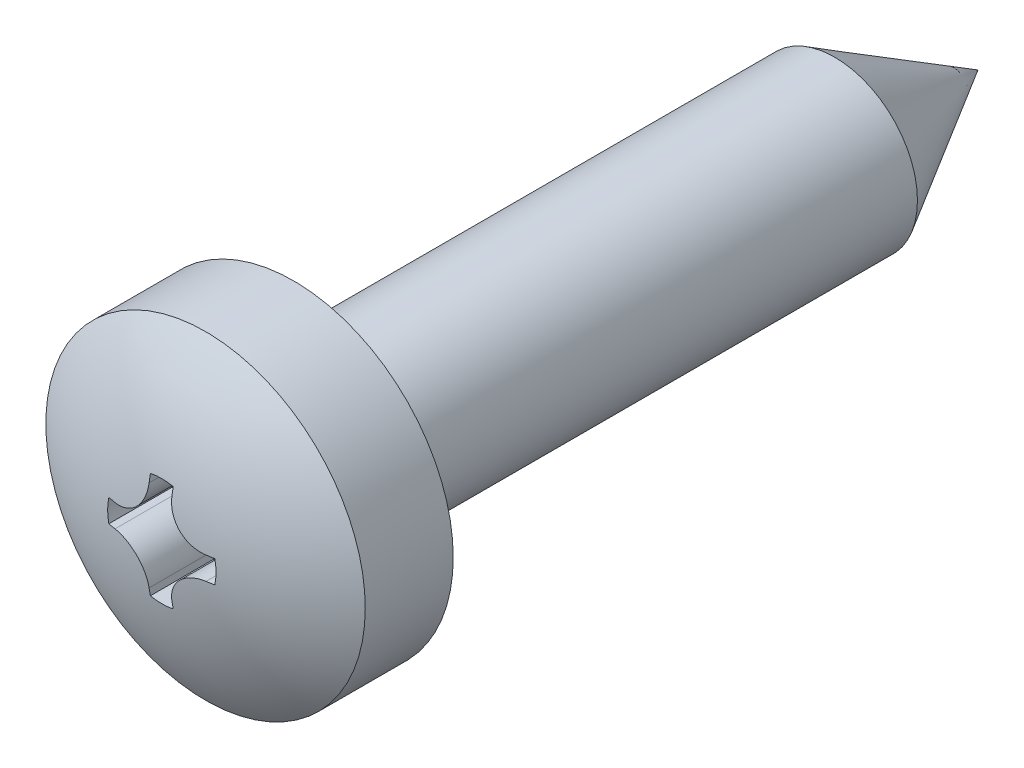
ISO-10303-21;
HEADER;
FILE_DESCRIPTION(('STEP AP214'),'2;1');
FILE_NAME('part.step','',(''),(''),'','','');
FILE_SCHEMA(('AUTOMOTIVE_DESIGN { 1 0 10303 214 1 1 1 1 }'));
ENDSEC;
DATA;
#1=APPLICATION_CONTEXT('core data for automotive mechanical design processes');
#2=APPLICATION_PROTOCOL_DEFINITION('international standard','automotive_design',2000,#1);
#3=PRODUCT_CONTEXT('',#1,'mechanical');
#4=PRODUCT('Part','Part','',(#3));
#5=PRODUCT_RELATED_PRODUCT_CATEGORY('part','',(#4));
#6=PRODUCT_DEFINITION_FORMATION('','',#4);
#7=PRODUCT_DEFINITION_CONTEXT('part definition',#1,'design');
#8=PRODUCT_DEFINITION('design','',#6,#7);
#9=PRODUCT_DEFINITION_SHAPE('','',#8);
#10=(LENGTH_UNIT() NAMED_UNIT(*) SI_UNIT(.MILLI.,.METRE.));
#11=(NAMED_UNIT(*) PLANE_ANGLE_UNIT() SI_UNIT($,.RADIAN.));
#12=(NAMED_UNIT(*) SI_UNIT($,.STERADIAN.) SOLID_ANGLE_UNIT());
#13=UNCERTAINTY_MEASURE_WITH_UNIT(LENGTH_MEASURE(1.E-05),#10,'distance_accuracy_value','');
#14=(GEOMETRIC_REPRESENTATION_CONTEXT(3) GLOBAL_UNCERTAINTY_ASSIGNED_CONTEXT((#13)) GLOBAL_UNIT_ASSIGNED_CONTEXT((#10,
#11,#12)) REPRESENTATION_CONTEXT('',''));
#15=CARTESIAN_POINT('',(0.,0.,0.));
#16=DIRECTION('',(0.,0.,1.));
#17=DIRECTION('',(1.,0.,0.));
#18=AXIS2_PLACEMENT_3D('',#15,#16,#17);
#19=CARTESIAN_POINT('',(0.,0.,9.4));
#20=DIRECTION('',(0.,0.,1.));
#21=DIRECTION('',(0.,1.,0.));
#22=AXIS2_PLACEMENT_3D('',#19,#20,#21);
#23=SPHERICAL_SURFACE('',#22,5.);
#24=CARTESIAN_POINT('',(0.,0.,13.5424630354416));
#25=DIRECTION('',(0.,0.,1.));
#26=DIRECTION('',(1.,0.,0.));
#27=AXIS2_PLACEMENT_3D('',#24,#25,#26);
#28=CIRCLE('',#27,2.8);
#29=CARTESIAN_POINT('',(2.8,0.,13.5424630354416));
#30=VERTEX_POINT('',#29);
#31=EDGE_CURVE('E190',#30,#30,#28,.T.);
#32=ORIENTED_EDGE('',*,*,#31,.T.);
#33=EDGE_LOOP('',(#32));
#34=FACE_BOUND('',#33,.T.);
#35=CARTESIAN_POINT('',(0.,0.,14.3089204515861));
#36=DIRECTION('',(0.,0.,-1.));
#37=DIRECTION('',(-1.,0.,0.));
#38=AXIS2_PLACEMENT_3D('',#35,#36,#37);
#39=CIRCLE('',#38,0.95);
#40=CARTESIAN_POINT('',(0.199999999999999,0.928708781050336,14.3089204515861));
#41=VERTEX_POINT('',#40);
#42=CARTESIAN_POINT('',(-0.199999999999997,0.928708781050336,14.3089204515861));
#43=VERTEX_POINT('',#42);
#44=EDGE_CURVE('E298',#41,#43,#39,.F.);
#45=ORIENTED_EDGE('',*,*,#44,.F.);
#46=CARTESIAN_POINT('',(0.200000000000013,0.,9.4));
#47=DIRECTION('',(-1.,0.,0.));
#48=DIRECTION('',(0.,-1.,0.));
#49=AXIS2_PLACEMENT_3D('',#46,#47,#48);
#50=CIRCLE('',#49,4.99599839871872);
#51=CARTESIAN_POINT('',(0.200000000000001,0.797500009462237,14.3319361040982));
#52=VERTEX_POINT('',#51);
#53=EDGE_CURVE('E176',#52,#41,#50,.T.);
#54=ORIENTED_EDGE('',*,*,#53,.F.);
#55=CARTESIAN_POINT('',(0.200000033472805,0.797700009462236,14.3319037583386));
#56=CARTESIAN_POINT('',(0.199959253117828,0.764708817685606,14.3372450026347));
#57=CARTESIAN_POINT('',(0.202709128813232,0.731640466129004,14.3421389681577));
#58=CARTESIAN_POINT('',(0.213653637195818,0.666282732986849,14.3509117634436));
#59=CARTESIAN_POINT('',(0.221847801353419,0.633993284617508,14.3547906805205));
#60=CARTESIAN_POINT('',(0.243555568778322,0.571088201610532,14.3614171793675));
#61=CARTESIAN_POINT('',(0.257074653927373,0.540474329048727,14.364163589265));
#62=CARTESIAN_POINT('',(0.289068737352572,0.481878485435129,14.3684353734394));
#63=CARTESIAN_POINT('',(0.307541534947129,0.453895353117194,14.3699612887238));
#64=CARTESIAN_POINT('',(0.348646595686665,0.401741777280698,14.371733860277));
#65=CARTESIAN_POINT('',(0.371219136327946,0.377524829205055,14.3719975623989));
#66=CARTESIAN_POINT('',(0.42004221247523,0.33315104363588,14.3712838517845));
#67=CARTESIAN_POINT('',(0.446293163672993,0.312994665649831,14.3703062986749));
#68=CARTESIAN_POINT('',(0.501529122246131,0.277422821121843,14.3671501235125));
#69=CARTESIAN_POINT('',(0.530496065410742,0.261978583187333,14.3649790268822));
#70=CARTESIAN_POINT('',(0.590474078177402,0.236061672214504,14.3595049326867));
#71=CARTESIAN_POINT('',(0.621484749229964,0.225588033102557,14.3562021552872));
#72=CARTESIAN_POINT('',(0.676782180778131,0.211811110107704,14.349515949383));
#73=CARTESIAN_POINT('',(0.700820773823944,0.207371844731834,14.3463573247891));
#74=CARTESIAN_POINT('',(0.749150929493059,0.201461310152338,14.3395132745871));
#75=CARTESIAN_POINT('',(0.773442081704409,0.199985810303452,14.3358286079455));
#76=CARTESIAN_POINT('',(0.797700009462238,0.200000033472804,14.3319037583386));
#77=B_SPLINE_CURVE_WITH_KNOTS('',3,(#55,#56,#57,#58,#59,#60,#61,#62,#63,#64,#65,#66,#67,#68,#69,
#70,#71,#72,#73,#74,#75,#76),.UNSPECIFIED.,.F.,.F.,(4,2,2,2,2,2,2,2,2,2,4),(0.,
0.100151318053274,0.200294018308518,0.30054008372607,0.400741688499828,0.499586204595047,
0.598441899985654,0.696681331546744,0.794901661700852,0.868668187611341,0.942329339997771),.UNSPECIFIED.);
#78=CARTESIAN_POINT('',(0.797500009462238,0.2,14.3319361040982));
#79=VERTEX_POINT('',#78);
#80=EDGE_CURVE('E288',#52,#79,#77,.T.);
#81=ORIENTED_EDGE('',*,*,#80,.T.);
#82=CARTESIAN_POINT('',(0.,0.200000000000013,9.4));
#83=DIRECTION('',(0.,1.,0.));
#84=DIRECTION('',(-1.,0.,0.));
#85=AXIS2_PLACEMENT_3D('',#82,#83,#84);
#86=CIRCLE('',#85,4.99599839871872);
#87=CARTESIAN_POINT('',(0.928708781050337,0.199999999999998,14.3089204515861));
#88=VERTEX_POINT('',#87);
#89=EDGE_CURVE('E296',#79,#88,#86,.T.);
#90=ORIENTED_EDGE('',*,*,#89,.T.);
#91=CARTESIAN_POINT('',(0.,0.,14.3089204515861));
#92=DIRECTION('',(0.,0.,-1.));
#93=DIRECTION('',(-1.,0.,0.));
#94=AXIS2_PLACEMENT_3D('',#91,#92,#93);
#95=CIRCLE('',#94,0.950000000000001);
#96=CARTESIAN_POINT('',(0.928708781050337,-0.199999999999996,14.3089204515861));
#97=VERTEX_POINT('',#96);
#98=EDGE_CURVE('E371',#88,#97,#95,.T.);
#99=ORIENTED_EDGE('',*,*,#98,.T.);
#100=CARTESIAN_POINT('',(0.,-0.200000000000022,9.4));
#101=DIRECTION('',(0.,1.,0.));
#102=DIRECTION('',(-1.,0.,0.));
#103=AXIS2_PLACEMENT_3D('',#100,#101,#102);
#104=CIRCLE('',#103,4.99599839871872);
#105=CARTESIAN_POINT('',(0.797500009462238,-0.2,14.3319361040982));
#106=VERTEX_POINT('',#105);
#107=EDGE_CURVE('E260',#106,#97,#104,.T.);
#108=ORIENTED_EDGE('',*,*,#107,.F.);
#109=CARTESIAN_POINT('',(0.200000033472805,-0.797700009462236,14.3319037583386));
#110=CARTESIAN_POINT('',(0.199959253117828,-0.764708817685605,14.3372450026347));
#111=CARTESIAN_POINT('',(0.202709128813232,-0.731640466129003,14.3421389681577));
#112=CARTESIAN_POINT('',(0.213653637195818,-0.666282732986848,14.3509117634436));
#113=CARTESIAN_POINT('',(0.221847801353419,-0.633993284617508,14.3547906805205));
#114=CARTESIAN_POINT('',(0.243555568778322,-0.571088201610531,14.3614171793675));
#115=CARTESIAN_POINT('',(0.257074653927373,-0.540474329048727,14.364163589265));
#116=CARTESIAN_POINT('',(0.289068737352572,-0.481878485435129,14.3684353734394));
#117=CARTESIAN_POINT('',(0.30754153494713,-0.453895353117194,14.3699612887238));
#118=CARTESIAN_POINT('',(0.348646595686666,-0.401741777280697,14.371733860277));
#119=CARTESIAN_POINT('',(0.371219136327946,-0.377524829205055,14.3719975623989));
#120=CARTESIAN_POINT('',(0.42004221247523,-0.33315104363588,14.3712838517845));
#121=CARTESIAN_POINT('',(0.446293163672993,-0.31299466564983,14.370306298675));
#122=CARTESIAN_POINT('',(0.501529122246131,-0.277422821121843,14.3671501235125));
#123=CARTESIAN_POINT('',(0.530496065410743,-0.261978583187333,14.3649790268822));
#124=CARTESIAN_POINT('',(0.590474078177402,-0.236061672214504,14.3595049326867));
#125=CARTESIAN_POINT('',(0.621484749229964,-0.225588033102557,14.3562021552872));
#126=CARTESIAN_POINT('',(0.676782180778131,-0.211811110107704,14.349515949383));
#127=CARTESIAN_POINT('',(0.700820773823944,-0.207371844731834,14.3463573247891));
#128=CARTESIAN_POINT('',(0.749150929493059,-0.201461310152338,14.3395132745871));
#129=CARTESIAN_POINT('',(0.773442081704409,-0.199985810303452,14.3358286079455));
#130=CARTESIAN_POINT('',(0.797700009462237,-0.200000033472804,14.3319037583386));
#131=B_SPLINE_CURVE_WITH_KNOTS('',3,(#109,#110,#111,#112,#113,#114,#115,#116,#117,#118,#119,
#120,#121,#122,#123,#124,#125,#126,#127,#128,#129,#130),.UNSPECIFIED.,.F.,.F.,(4,2,2,2,2,2,2,2,
2,2,4),(0.,0.100151318053274,0.200294018308518,0.300540083726071,0.400741688499828,
0.499586204595048,0.598441899985654,0.696681331546745,0.794901661700852,0.868668187611341,
0.94232933999777),.UNSPECIFIED.);
#132=CARTESIAN_POINT('',(0.200000000000001,-0.797500009462237,14.3319361040982));
#133=VERTEX_POINT('',#132);
#134=EDGE_CURVE('E253',#133,#106,#131,.T.);
#135=ORIENTED_EDGE('',*,*,#134,.F.);
#136=CARTESIAN_POINT('',(0.20000000000001,0.,9.4));
#137=DIRECTION('',(1.,0.,0.));
#138=DIRECTION('',(0.,1.,0.));
#139=AXIS2_PLACEMENT_3D('',#136,#137,#138);
#140=CIRCLE('',#139,4.99599839871872);
#141=CARTESIAN_POINT('',(0.199999999999999,-0.928708781050336,14.3089204515861));
#142=VERTEX_POINT('',#141);
#143=EDGE_CURVE('E250',#133,#142,#140,.T.);
#144=ORIENTED_EDGE('',*,*,#143,.T.);
#145=CARTESIAN_POINT('',(0.,0.,14.3089204515861));
#146=DIRECTION('',(0.,0.,-1.));
#147=DIRECTION('',(-1.,0.,0.));
#148=AXIS2_PLACEMENT_3D('',#145,#146,#147);
#149=CIRCLE('',#148,0.95);
#150=CARTESIAN_POINT('',(-0.199999999999997,-0.928708781050336,14.3089204515861));
#151=VERTEX_POINT('',#150);
#152=EDGE_CURVE('E247',#142,#151,#149,.T.);
#153=ORIENTED_EDGE('',*,*,#152,.T.);
#154=CARTESIAN_POINT('',(-0.200000000000015,0.,9.4));
#155=DIRECTION('',(1.,0.,0.));
#156=DIRECTION('',(0.,1.,0.));
#157=AXIS2_PLACEMENT_3D('',#154,#155,#156);
#158=CIRCLE('',#157,4.99599839871872);
#159=CARTESIAN_POINT('',(-0.2,-0.797500009462236,14.3319361040982));
#160=VERTEX_POINT('',#159);
#161=EDGE_CURVE('E244',#160,#151,#158,.T.);
#162=ORIENTED_EDGE('',*,*,#161,.F.);
#163=CARTESIAN_POINT('',(-0.200000033472803,-0.797700009462235,14.3319037583386));
#164=CARTESIAN_POINT('',(-0.199959253117827,-0.764708817685605,14.3372450026347));
#165=CARTESIAN_POINT('',(-0.202709128813231,-0.731640466129003,14.3421389681577));
#166=CARTESIAN_POINT('',(-0.213653637195817,-0.666282732986847,14.3509117634436));
#167=CARTESIAN_POINT('',(-0.221847801353417,-0.633993284617507,14.3547906805205));
#168=CARTESIAN_POINT('',(-0.243555568778321,-0.57108820161053,14.3614171793675));
#169=CARTESIAN_POINT('',(-0.257074653927372,-0.540474329048725,14.364163589265));
#170=CARTESIAN_POINT('',(-0.289068737352571,-0.481878485435128,14.3684353734394));
#171=CARTESIAN_POINT('',(-0.307541534947129,-0.453895353117193,14.3699612887238));
#172=CARTESIAN_POINT('',(-0.348646595686664,-0.401741777280696,14.371733860277));
#173=CARTESIAN_POINT('',(-0.371219136327945,-0.377524829205054,14.3719975623989));
#174=CARTESIAN_POINT('',(-0.420042212475229,-0.333151043635879,14.3712838517845));
#175=CARTESIAN_POINT('',(-0.446293163672992,-0.312994665649829,14.370306298675));
#176=CARTESIAN_POINT('',(-0.50152912224613,-0.277422821121842,14.3671501235125));
#177=CARTESIAN_POINT('',(-0.530496065410741,-0.261978583187332,14.3649790268822));
#178=CARTESIAN_POINT('',(-0.590474078177401,-0.236061672214503,14.3595049326867));
#179=CARTESIAN_POINT('',(-0.621484749229963,-0.225588033102557,14.3562021552872));
#180=CARTESIAN_POINT('',(-0.676782180778129,-0.211811110107703,14.349515949383));
#181=CARTESIAN_POINT('',(-0.700820773823943,-0.207371844731833,14.3463573247891));
#182=CARTESIAN_POINT('',(-0.749150929493057,-0.201461310152337,14.3395132745871));
#183=CARTESIAN_POINT('',(-0.773442081704407,-0.199985810303451,14.3358286079455));
#184=CARTESIAN_POINT('',(-0.797700009462235,-0.200000033472803,14.3319037583386));
#185=B_SPLINE_CURVE_WITH_KNOTS('',3,(#163,#164,#165,#166,#167,#168,#169,#170,#171,#172,#173,
#174,#175,#176,#177,#178,#179,#180,#181,#182,#183,#184),.UNSPECIFIED.,.F.,.F.,(4,2,2,2,2,2,2,2,
2,2,4),(0.,0.100151318053273,0.200294018308518,0.300540083726071,0.400741688499828,
0.499586204595048,0.598441899985654,0.696681331546744,0.794901661700852,0.868668187611341,
0.942329339997769),.UNSPECIFIED.);
#186=CARTESIAN_POINT('',(-0.797500009462236,-0.199999999999999,14.3319361040982));
#187=VERTEX_POINT('',#186);
#188=EDGE_CURVE('E236',#160,#187,#185,.T.);
#189=ORIENTED_EDGE('',*,*,#188,.T.);
#190=CARTESIAN_POINT('',(0.,-0.200000000000015,9.4));
#191=DIRECTION('',(0.,-1.,0.));
#192=DIRECTION('',(1.,0.,0.));
#193=AXIS2_PLACEMENT_3D('',#190,#191,#192);
#194=CIRCLE('',#193,4.99599839871872);
#195=CARTESIAN_POINT('',(-0.928708781050336,-0.199999999999997,14.3089204515861));
#196=VERTEX_POINT('',#195);
#197=EDGE_CURVE('E245',#187,#196,#194,.T.);
#198=ORIENTED_EDGE('',*,*,#197,.T.);
#199=CARTESIAN_POINT('',(0.,0.,14.3089204515861));
#200=DIRECTION('',(0.,0.,-1.));
#201=DIRECTION('',(-1.,0.,0.));
#202=AXIS2_PLACEMENT_3D('',#199,#200,#201);
#203=CIRCLE('',#202,0.95);
#204=CARTESIAN_POINT('',(-0.928708781050336,0.199999999999997,14.3089204515861));
#205=VERTEX_POINT('',#204);
#206=EDGE_CURVE('E410',#205,#196,#203,.F.);
#207=ORIENTED_EDGE('',*,*,#206,.F.);
#208=CARTESIAN_POINT('',(0.,0.200000000000015,9.4));
#209=DIRECTION('',(0.,-1.,0.));
#210=DIRECTION('',(1.,0.,0.));
#211=AXIS2_PLACEMENT_3D('',#208,#209,#210);
#212=CIRCLE('',#211,4.99599839871872);
#213=CARTESIAN_POINT('',(-0.797500009462236,0.199999999999999,14.3319361040982));
#214=VERTEX_POINT('',#213);
#215=EDGE_CURVE('E204',#214,#205,#212,.T.);
#216=ORIENTED_EDGE('',*,*,#215,.F.);
#217=CARTESIAN_POINT('',(-0.200000033472804,0.797700009462235,14.3319037583386));
#218=CARTESIAN_POINT('',(-0.199959253117827,0.764708817685605,14.3372450026347));
#219=CARTESIAN_POINT('',(-0.202709128813231,0.731640466129002,14.3421389681577));
#220=CARTESIAN_POINT('',(-0.213653637195817,0.666282732986847,14.3509117634436));
#221=CARTESIAN_POINT('',(-0.221847801353417,0.633993284617507,14.3547906805205));
#222=CARTESIAN_POINT('',(-0.24355556877832,0.571088201610531,14.3614171793675));
#223=CARTESIAN_POINT('',(-0.257074653927372,0.540474329048726,14.364163589265));
#224=CARTESIAN_POINT('',(-0.28906873735257,0.481878485435128,14.3684353734394));
#225=CARTESIAN_POINT('',(-0.307541534947128,0.453895353117193,14.3699612887238));
#226=CARTESIAN_POINT('',(-0.348646595686664,0.401741777280697,14.371733860277));
#227=CARTESIAN_POINT('',(-0.371219136327945,0.377524829205054,14.3719975623989));
#228=CARTESIAN_POINT('',(-0.420042212475228,0.333151043635879,14.3712838517845));
#229=CARTESIAN_POINT('',(-0.446293163672991,0.31299466564983,14.370306298675));
#230=CARTESIAN_POINT('',(-0.501529122246129,0.277422821121843,14.3671501235125));
#231=CARTESIAN_POINT('',(-0.530496065410741,0.261978583187332,14.3649790268822));
#232=CARTESIAN_POINT('',(-0.5904740781774,0.236061672214503,14.3595049326867));
#233=CARTESIAN_POINT('',(-0.621484749229962,0.225588033102557,14.3562021552872));
#234=CARTESIAN_POINT('',(-0.676782180778129,0.211811110107703,14.349515949383));
#235=CARTESIAN_POINT('',(-0.700820773823943,0.207371844731833,14.3463573247891));
#236=CARTESIAN_POINT('',(-0.749150929493057,0.201461310152337,14.3395132745871));
#237=CARTESIAN_POINT('',(-0.773442081704407,0.199985810303451,14.3358286079455));
#238=CARTESIAN_POINT('',(-0.797700009462235,0.200000033472803,14.3319037583386));
#239=B_SPLINE_CURVE_WITH_KNOTS('',3,(#217,#218,#219,#220,#221,#222,#223,#224,#225,#226,#227,
#228,#229,#230,#231,#232,#233,#234,#235,#236,#237,#238),.UNSPECIFIED.,.F.,.F.,(4,2,2,2,2,2,2,2,
2,2,4),(0.,0.100151318053274,0.200294018308518,0.30054008372607,0.400741688499828,
0.499586204595047,0.598441899985653,0.696681331546744,0.794901661700851,0.868668187611341,
0.94232933999777),.UNSPECIFIED.);
#240=CARTESIAN_POINT('',(-0.2,0.797500009462236,14.3319361040982));
#241=VERTEX_POINT('',#240);
#242=EDGE_CURVE('E196',#241,#214,#239,.T.);
#243=ORIENTED_EDGE('',*,*,#242,.F.);
#244=CARTESIAN_POINT('',(-0.200000000000015,0.,9.4));
#245=DIRECTION('',(-1.,0.,0.));
#246=DIRECTION('',(0.,-1.,0.));
#247=AXIS2_PLACEMENT_3D('',#244,#245,#246);
#248=CIRCLE('',#247,4.99599839871872);
#249=EDGE_CURVE('E193',#241,#43,#248,.T.);
#250=ORIENTED_EDGE('',*,*,#249,.T.);
#251=EDGE_LOOP('',(#45,#54,#81,#90,#99,#108,#135,#144,#153,#162,#189,#198,#207,#216,#243,#250));
#252=FACE_BOUND('',#251,.T.);
#253=ADVANCED_FACE('F41',(#34,#252),#23,.T.);
#254=CARTESIAN_POINT('',(0.,0.,0.));
#255=DIRECTION('',(0.,0.,1.));
#256=DIRECTION('',(1.,0.,0.));
#257=AXIS2_PLACEMENT_3D('',#254,#255,#256);
#258=CONICAL_SURFACE('',#257,0.,0.523598775598293);
#259=CARTESIAN_POINT('',(0.,0.,2.5114736709749));
#260=DIRECTION('',(0.,0.,1.));
#261=DIRECTION('',(1.,0.,0.));
#262=AXIS2_PLACEMENT_3D('',#259,#260,#261);
#263=CIRCLE('',#262,1.45);
#264=CARTESIAN_POINT('',(1.45,0.,2.5114736709749));
#265=VERTEX_POINT('',#264);
#266=EDGE_CURVE('E177',#265,#265,#263,.T.);
#267=ORIENTED_EDGE('',*,*,#266,.F.);
#268=EDGE_LOOP('',(#267));
#269=FACE_BOUND('',#268,.T.);
#270=CARTESIAN_POINT('',(0.,0.,0.));
#271=VERTEX_POINT('',#270);
#272=VERTEX_LOOP('',#271);
#273=FACE_BOUND('',#272,.T.);
#274=ADVANCED_FACE('F312',(#269,#273),#258,.T.);
#275=CARTESIAN_POINT('',(0.,0.,11.71));
#276=DIRECTION('',(0.,0.,1.));
#277=DIRECTION('',(1.,0.,0.));
#278=AXIS2_PLACEMENT_3D('',#275,#276,#277);
#279=CYLINDRICAL_SURFACE('',#278,2.8);
#280=ORIENTED_EDGE('',*,*,#31,.F.);
#281=EDGE_LOOP('',(#280));
#282=FACE_BOUND('',#281,.T.);
#283=CARTESIAN_POINT('',(0.,0.,12.));
#284=DIRECTION('',(0.,0.,1.));
#285=DIRECTION('',(1.,0.,0.));
#286=AXIS2_PLACEMENT_3D('',#283,#284,#285);
#287=CIRCLE('',#286,2.8);
#288=CARTESIAN_POINT('',(2.8,0.,12.));
#289=VERTEX_POINT('',#288);
#290=EDGE_CURVE('E181',#289,#289,#287,.T.);
#291=ORIENTED_EDGE('',*,*,#290,.T.);
#292=EDGE_LOOP('',(#291));
#293=FACE_BOUND('',#292,.T.);
#294=ADVANCED_FACE('F317',(#282,#293),#279,.T.);
#295=CARTESIAN_POINT('',(0.,2.8,12.));
#296=DIRECTION('',(0.,0.,1.));
#297=DIRECTION('',(1.,0.,0.));
#298=AXIS2_PLACEMENT_3D('',#295,#296,#297);
#299=PLANE('',#298);
#300=CARTESIAN_POINT('',(0.,0.,12.));
#301=DIRECTION('',(0.,0.,1.));
#302=DIRECTION('',(1.,0.,0.));
#303=AXIS2_PLACEMENT_3D('',#300,#301,#302);
#304=CIRCLE('',#303,1.55);
#305=CARTESIAN_POINT('',(1.55,0.,12.));
#306=VERTEX_POINT('',#305);
#307=EDGE_CURVE('E50',#306,#306,#304,.T.);
#308=ORIENTED_EDGE('',*,*,#307,.T.);
#309=EDGE_LOOP('',(#308));
#310=FACE_BOUND('',#309,.T.);
#311=ORIENTED_EDGE('',*,*,#290,.F.);
#312=EDGE_LOOP('',(#311));
#313=FACE_BOUND('',#312,.T.);
#314=ADVANCED_FACE('F302',(#310,#313),#299,.F.);
#315=CARTESIAN_POINT('',(0.,0.,11.71));
#316=DIRECTION('',(0.,0.,1.));
#317=DIRECTION('',(1.,0.,0.));
#318=AXIS2_PLACEMENT_3D('',#315,#316,#317);
#319=CYLINDRICAL_SURFACE('',#318,1.45);
#320=CARTESIAN_POINT('',(0.,0.,11.9));
#321=DIRECTION('',(0.,0.,1.));
#322=DIRECTION('',(1.,0.,0.));
#323=AXIS2_PLACEMENT_3D('',#320,#321,#322);
#324=CIRCLE('',#323,1.45);
#325=CARTESIAN_POINT('',(1.45,0.,11.9));
#326=VERTEX_POINT('',#325);
#327=EDGE_CURVE('E11',#326,#326,#324,.F.);
#328=ORIENTED_EDGE('',*,*,#327,.T.);
#329=EDGE_LOOP('',(#328));
#330=FACE_BOUND('',#329,.T.);
#331=ORIENTED_EDGE('',*,*,#266,.T.);
#332=EDGE_LOOP('',(#331));
#333=FACE_BOUND('',#332,.T.);
#334=ADVANCED_FACE('F464',(#330,#333),#319,.T.);
#335=CARTESIAN_POINT('',(0.,0.,13.2));
#336=DIRECTION('',(0.,0.,1.));
#337=DIRECTION('',(1.,0.,0.));
#338=AXIS2_PLACEMENT_3D('',#335,#336,#337);
#339=CYLINDRICAL_SURFACE('',#338,0.95);
#340=ORIENTED_EDGE('',*,*,#44,.T.);
#341=DIRECTION('',(0.,0.,1.));
#342=VECTOR('',#341,1.);
#343=CARTESIAN_POINT('',(-0.199999999999997,0.928708781050336,13.2));
#344=LINE('',#343,#342);
#345=CARTESIAN_POINT('',(-0.199999999999997,0.928708781050336,13.2));
#346=VERTEX_POINT('',#345);
#347=EDGE_CURVE('E57',#346,#43,#344,.T.);
#348=ORIENTED_EDGE('',*,*,#347,.F.);
#349=CARTESIAN_POINT('',(0.,0.,13.2));
#350=DIRECTION('',(0.,0.,-1.));
#351=DIRECTION('',(-1.,0.,0.));
#352=AXIS2_PLACEMENT_3D('',#349,#350,#351);
#353=CIRCLE('',#352,0.95);
#354=CARTESIAN_POINT('',(0.199999999999999,0.928708781050336,13.2));
#355=VERTEX_POINT('',#354);
#356=EDGE_CURVE('E159',#346,#355,#353,.T.);
#357=ORIENTED_EDGE('',*,*,#356,.T.);
#358=DIRECTION('',(0.,0.,1.));
#359=VECTOR('',#358,1.);
#360=CARTESIAN_POINT('',(0.199999999999999,0.928708781050336,13.2));
#361=LINE('',#360,#359);
#362=EDGE_CURVE('E171',#355,#41,#361,.T.);
#363=ORIENTED_EDGE('',*,*,#362,.T.);
#364=EDGE_LOOP('',(#340,#348,#357,#363));
#365=FACE_BOUND('',#364,.T.);
#366=ADVANCED_FACE('F170',(#365),#339,.F.);
#367=CARTESIAN_POINT('',(0.199999999999999,0.928708781050336,13.2));
#368=DIRECTION('',(-1.,0.,0.));
#369=DIRECTION('',(0.,-1.,0.));
#370=AXIS2_PLACEMENT_3D('',#367,#368,#369);
#371=PLANE('',#370);
#372=ORIENTED_EDGE('',*,*,#53,.T.);
#373=ORIENTED_EDGE('',*,*,#362,.F.);
#374=DIRECTION('',(0.,-1.,0.));
#375=VECTOR('',#374,1.);
#376=CARTESIAN_POINT('',(0.199999999999999,0.928708781050336,13.2));
#377=LINE('',#376,#375);
#378=CARTESIAN_POINT('',(0.200000000000001,0.797500009462237,13.2));
#379=VERTEX_POINT('',#378);
#380=EDGE_CURVE('E155',#355,#379,#377,.T.);
#381=ORIENTED_EDGE('',*,*,#380,.T.);
#382=DIRECTION('',(0.,0.,1.));
#383=VECTOR('',#382,1.);
#384=CARTESIAN_POINT('',(0.200000000000001,0.797500009462237,13.2));
#385=LINE('',#384,#383);
#386=EDGE_CURVE('E178',#379,#52,#385,.T.);
#387=ORIENTED_EDGE('',*,*,#386,.T.);
#388=EDGE_LOOP('',(#372,#373,#381,#387));
#389=FACE_BOUND('',#388,.T.);
#390=ADVANCED_FACE('F174',(#389),#371,.T.);
#391=CARTESIAN_POINT('',(0.797500009462238,0.797500009462237,13.2));
#392=DIRECTION('',(0.,0.,1.));
#393=DIRECTION('',(1.,0.,0.));
#394=AXIS2_PLACEMENT_3D('',#391,#392,#393);
#395=CYLINDRICAL_SURFACE('',#394,0.597500009462237);
#396=ORIENTED_EDGE('',*,*,#386,.F.);
#397=CARTESIAN_POINT('',(0.797500009462238,0.797500009462237,13.2));
#398=DIRECTION('',(0.,0.,-1.));
#399=DIRECTION('',(-1.,0.,0.));
#400=AXIS2_PLACEMENT_3D('',#397,#398,#399);
#401=CIRCLE('',#400,0.597500009462237);
#402=CARTESIAN_POINT('',(0.797500009462238,0.2,13.2));
#403=VERTEX_POINT('',#402);
#404=EDGE_CURVE('E162',#403,#379,#401,.T.);
#405=ORIENTED_EDGE('',*,*,#404,.F.);
#406=DIRECTION('',(0.,0.,1.));
#407=VECTOR('',#406,1.);
#408=CARTESIAN_POINT('',(0.797500009462238,0.2,13.2));
#409=LINE('',#408,#407);
#410=EDGE_CURVE('E183',#403,#79,#409,.T.);
#411=ORIENTED_EDGE('',*,*,#410,.T.);
#412=ORIENTED_EDGE('',*,*,#80,.F.);
#413=EDGE_LOOP('',(#396,#405,#411,#412));
#414=FACE_BOUND('',#413,.T.);
#415=ADVANCED_FACE('F280',(#414),#395,.T.);
#416=CARTESIAN_POINT('',(0.928708781050337,0.199999999999998,13.2));
#417=DIRECTION('',(0.,1.,0.));
#418=DIRECTION('',(-1.,0.,0.));
#419=AXIS2_PLACEMENT_3D('',#416,#417,#418);
#420=PLANE('',#419);
#421=ORIENTED_EDGE('',*,*,#410,.F.);
#422=DIRECTION('',(-1.,0.,0.));
#423=VECTOR('',#422,1.);
#424=CARTESIAN_POINT('',(0.928708781050337,0.199999999999998,13.2));
#425=LINE('',#424,#423);
#426=CARTESIAN_POINT('',(0.928708781050337,0.199999999999998,13.2));
#427=VERTEX_POINT('',#426);
#428=EDGE_CURVE('E379',#427,#403,#425,.T.);
#429=ORIENTED_EDGE('',*,*,#428,.F.);
#430=DIRECTION('',(0.,0.,1.));
#431=VECTOR('',#430,1.);
#432=CARTESIAN_POINT('',(0.928708781050337,0.199999999999998,13.2));
#433=LINE('',#432,#431);
#434=EDGE_CURVE('E364',#427,#88,#433,.T.);
#435=ORIENTED_EDGE('',*,*,#434,.T.);
#436=ORIENTED_EDGE('',*,*,#89,.F.);
#437=EDGE_LOOP('',(#421,#429,#435,#436));
#438=FACE_BOUND('',#437,.T.);
#439=ADVANCED_FACE('F276',(#438),#420,.F.);
#440=CARTESIAN_POINT('',(0.,0.,13.2));
#441=DIRECTION('',(0.,0.,1.));
#442=DIRECTION('',(1.,0.,0.));
#443=AXIS2_PLACEMENT_3D('',#440,#441,#442);
#444=CYLINDRICAL_SURFACE('',#443,0.950000000000001);
#445=ORIENTED_EDGE('',*,*,#434,.F.);
#446=CARTESIAN_POINT('',(0.,0.,13.2));
#447=DIRECTION('',(0.,0.,1.));
#448=DIRECTION('',(1.,0.,0.));
#449=AXIS2_PLACEMENT_3D('',#446,#447,#448);
#450=CIRCLE('',#449,0.950000000000001);
#451=CARTESIAN_POINT('',(0.928708781050337,-0.199999999999997,13.2));
#452=VERTEX_POINT('',#451);
#453=EDGE_CURVE('E377',#452,#427,#450,.T.);
#454=ORIENTED_EDGE('',*,*,#453,.F.);
#455=DIRECTION('',(0.,0.,1.));
#456=VECTOR('',#455,1.);
#457=CARTESIAN_POINT('',(0.928708781050337,-0.199999999999997,13.2));
#458=LINE('',#457,#456);
#459=EDGE_CURVE('E361',#452,#97,#458,.T.);
#460=ORIENTED_EDGE('',*,*,#459,.T.);
#461=ORIENTED_EDGE('',*,*,#98,.F.);
#462=EDGE_LOOP('',(#445,#454,#460,#461));
#463=FACE_BOUND('',#462,.T.);
#464=ADVANCED_FACE('F272',(#463),#444,.F.);
#465=CARTESIAN_POINT('',(0.928708781050338,-0.199999999999996,13.2));
#466=DIRECTION('',(0.,1.,0.));
#467=DIRECTION('',(-1.,0.,0.));
#468=AXIS2_PLACEMENT_3D('',#465,#466,#467);
#469=PLANE('',#468);
#470=ORIENTED_EDGE('',*,*,#107,.T.);
#471=ORIENTED_EDGE('',*,*,#459,.F.);
#472=DIRECTION('',(-1.,0.,0.));
#473=VECTOR('',#472,1.);
#474=CARTESIAN_POINT('',(0.928708781050338,-0.199999999999996,13.2));
#475=LINE('',#474,#473);
#476=CARTESIAN_POINT('',(0.797500009462238,-0.2,13.2));
#477=VERTEX_POINT('',#476);
#478=EDGE_CURVE('E378',#452,#477,#475,.T.);
#479=ORIENTED_EDGE('',*,*,#478,.T.);
#480=DIRECTION('',(0.,0.,1.));
#481=VECTOR('',#480,1.);
#482=CARTESIAN_POINT('',(0.797500009462238,-0.2,13.2));
#483=LINE('',#482,#481);
#484=EDGE_CURVE('E358',#477,#106,#483,.T.);
#485=ORIENTED_EDGE('',*,*,#484,.T.);
#486=EDGE_LOOP('',(#470,#471,#479,#485));
#487=FACE_BOUND('',#486,.T.);
#488=ADVANCED_FACE('F268',(#487),#469,.T.);
#489=CARTESIAN_POINT('',(0.797500009462238,-0.797500009462237,13.2));
#490=DIRECTION('',(0.,0.,1.));
#491=DIRECTION('',(1.,0.,0.));
#492=AXIS2_PLACEMENT_3D('',#489,#490,#491);
#493=CYLINDRICAL_SURFACE('',#492,0.597500009462237);
#494=ORIENTED_EDGE('',*,*,#134,.T.);
#495=ORIENTED_EDGE('',*,*,#484,.F.);
#496=CARTESIAN_POINT('',(0.797500009462238,-0.797500009462237,13.2));
#497=DIRECTION('',(0.,0.,1.));
#498=DIRECTION('',(1.,0.,0.));
#499=AXIS2_PLACEMENT_3D('',#496,#497,#498);
#500=CIRCLE('',#499,0.597500009462237);
#501=CARTESIAN_POINT('',(0.200000000000001,-0.797500009462237,13.2));
#502=VERTEX_POINT('',#501);
#503=EDGE_CURVE('E381',#477,#502,#500,.T.);
#504=ORIENTED_EDGE('',*,*,#503,.T.);
#505=DIRECTION('',(0.,0.,1.));
#506=VECTOR('',#505,1.);
#507=CARTESIAN_POINT('',(0.200000000000001,-0.797500009462237,13.2));
#508=LINE('',#507,#506);
#509=EDGE_CURVE('E355',#502,#133,#508,.T.);
#510=ORIENTED_EDGE('',*,*,#509,.T.);
#511=EDGE_LOOP('',(#494,#495,#504,#510));
#512=FACE_BOUND('',#511,.T.);
#513=ADVANCED_FACE('F262',(#512),#493,.T.);
#514=CARTESIAN_POINT('',(0.199999999999999,-0.928708781050336,13.2));
#515=DIRECTION('',(1.,0.,0.));
#516=DIRECTION('',(0.,1.,0.));
#517=AXIS2_PLACEMENT_3D('',#514,#515,#516);
#518=PLANE('',#517);
#519=ORIENTED_EDGE('',*,*,#509,.F.);
#520=DIRECTION('',(0.,1.,0.));
#521=VECTOR('',#520,1.);
#522=CARTESIAN_POINT('',(0.199999999999999,-0.928708781050336,13.2));
#523=LINE('',#522,#521);
#524=CARTESIAN_POINT('',(0.199999999999999,-0.928708781050336,13.2));
#525=VERTEX_POINT('',#524);
#526=EDGE_CURVE('E387',#525,#502,#523,.T.);
#527=ORIENTED_EDGE('',*,*,#526,.F.);
#528=DIRECTION('',(0.,0.,1.));
#529=VECTOR('',#528,1.);
#530=CARTESIAN_POINT('',(0.199999999999999,-0.928708781050336,13.2));
#531=LINE('',#530,#529);
#532=EDGE_CURVE('E352',#525,#142,#531,.T.);
#533=ORIENTED_EDGE('',*,*,#532,.T.);
#534=ORIENTED_EDGE('',*,*,#143,.F.);
#535=EDGE_LOOP('',(#519,#527,#533,#534));
#536=FACE_BOUND('',#535,.T.);
#537=ADVANCED_FACE('F267',(#536),#518,.F.);
#538=CARTESIAN_POINT('',(0.,0.,13.2));
#539=DIRECTION('',(0.,0.,1.));
#540=DIRECTION('',(1.,0.,0.));
#541=AXIS2_PLACEMENT_3D('',#538,#539,#540);
#542=CYLINDRICAL_SURFACE('',#541,0.95);
#543=ORIENTED_EDGE('',*,*,#532,.F.);
#544=CARTESIAN_POINT('',(0.,0.,13.2));
#545=DIRECTION('',(0.,0.,1.));
#546=DIRECTION('',(1.,0.,0.));
#547=AXIS2_PLACEMENT_3D('',#544,#545,#546);
#548=CIRCLE('',#547,0.95);
#549=CARTESIAN_POINT('',(-0.199999999999997,-0.928708781050336,13.2));
#550=VERTEX_POINT('',#549);
#551=EDGE_CURVE('E390',#550,#525,#548,.T.);
#552=ORIENTED_EDGE('',*,*,#551,.F.);
#553=DIRECTION('',(0.,0.,1.));
#554=VECTOR('',#553,1.);
#555=CARTESIAN_POINT('',(-0.199999999999997,-0.928708781050336,13.2));
#556=LINE('',#555,#554);
#557=EDGE_CURVE('E349',#550,#151,#556,.T.);
#558=ORIENTED_EDGE('',*,*,#557,.T.);
#559=ORIENTED_EDGE('',*,*,#152,.F.);
#560=EDGE_LOOP('',(#543,#552,#558,#559));
#561=FACE_BOUND('',#560,.T.);
#562=ADVANCED_FACE('F419',(#561),#542,.F.);
#563=CARTESIAN_POINT('',(-0.199999999999997,-0.928708781050336,13.2));
#564=DIRECTION('',(1.,0.,0.));
#565=DIRECTION('',(0.,1.,0.));
#566=AXIS2_PLACEMENT_3D('',#563,#564,#565);
#567=PLANE('',#566);
#568=ORIENTED_EDGE('',*,*,#161,.T.);
#569=ORIENTED_EDGE('',*,*,#557,.F.);
#570=DIRECTION('',(0.,1.,0.));
#571=VECTOR('',#570,1.);
#572=CARTESIAN_POINT('',(-0.199999999999997,-0.928708781050336,13.2));
#573=LINE('',#572,#571);
#574=CARTESIAN_POINT('',(-0.2,-0.797500009462236,13.2));
#575=VERTEX_POINT('',#574);
#576=EDGE_CURVE('E393',#550,#575,#573,.T.);
#577=ORIENTED_EDGE('',*,*,#576,.T.);
#578=DIRECTION('',(0.,0.,1.));
#579=VECTOR('',#578,1.);
#580=CARTESIAN_POINT('',(-0.2,-0.797500009462236,13.2));
#581=LINE('',#580,#579);
#582=EDGE_CURVE('E346',#575,#160,#581,.T.);
#583=ORIENTED_EDGE('',*,*,#582,.T.);
#584=EDGE_LOOP('',(#568,#569,#577,#583));
#585=FACE_BOUND('',#584,.T.);
#586=ADVANCED_FACE('F232',(#585),#567,.T.);
#587=CARTESIAN_POINT('',(-0.797500009462237,-0.797500009462236,13.2));
#588=DIRECTION('',(0.,0.,1.));
#589=DIRECTION('',(1.,0.,0.));
#590=AXIS2_PLACEMENT_3D('',#587,#588,#589);
#591=CYLINDRICAL_SURFACE('',#590,0.597500009462237);
#592=ORIENTED_EDGE('',*,*,#582,.F.);
#593=CARTESIAN_POINT('',(-0.797500009462237,-0.797500009462236,13.2));
#594=DIRECTION('',(0.,0.,-1.));
#595=DIRECTION('',(-1.,0.,0.));
#596=AXIS2_PLACEMENT_3D('',#593,#594,#595);
#597=CIRCLE('',#596,0.597500009462237);
#598=CARTESIAN_POINT('',(-0.797500009462236,-0.199999999999999,13.2));
#599=VERTEX_POINT('',#598);
#600=EDGE_CURVE('E395',#599,#575,#597,.T.);
#601=ORIENTED_EDGE('',*,*,#600,.F.);
#602=DIRECTION('',(0.,0.,1.));
#603=VECTOR('',#602,1.);
#604=CARTESIAN_POINT('',(-0.797500009462236,-0.199999999999999,13.2));
#605=LINE('',#604,#603);
#606=EDGE_CURVE('E343',#599,#187,#605,.T.);
#607=ORIENTED_EDGE('',*,*,#606,.T.);
#608=ORIENTED_EDGE('',*,*,#188,.F.);
#609=EDGE_LOOP('',(#592,#601,#607,#608));
#610=FACE_BOUND('',#609,.T.);
#611=ADVANCED_FACE('F227',(#610),#591,.T.);
#612=CARTESIAN_POINT('',(-0.928708781050336,-0.199999999999997,13.2));
#613=DIRECTION('',(0.,-1.,0.));
#614=DIRECTION('',(1.,0.,0.));
#615=AXIS2_PLACEMENT_3D('',#612,#613,#614);
#616=PLANE('',#615);
#617=ORIENTED_EDGE('',*,*,#606,.F.);
#618=DIRECTION('',(1.,0.,0.));
#619=VECTOR('',#618,1.);
#620=CARTESIAN_POINT('',(-0.928708781050336,-0.199999999999997,13.2));
#621=LINE('',#620,#619);
#622=CARTESIAN_POINT('',(-0.928708781050336,-0.199999999999997,13.2));
#623=VERTEX_POINT('',#622);
#624=EDGE_CURVE('E398',#623,#599,#621,.T.);
#625=ORIENTED_EDGE('',*,*,#624,.F.);
#626=DIRECTION('',(0.,0.,1.));
#627=VECTOR('',#626,1.);
#628=CARTESIAN_POINT('',(-0.928708781050336,-0.199999999999997,13.2));
#629=LINE('',#628,#627);
#630=EDGE_CURVE('E340',#623,#196,#629,.T.);
#631=ORIENTED_EDGE('',*,*,#630,.T.);
#632=ORIENTED_EDGE('',*,*,#197,.F.);
#633=EDGE_LOOP('',(#617,#625,#631,#632));
#634=FACE_BOUND('',#633,.T.);
#635=ADVANCED_FACE('F223',(#634),#616,.F.);
#636=CARTESIAN_POINT('',(0.,0.,13.2));
#637=DIRECTION('',(0.,0.,1.));
#638=DIRECTION('',(1.,0.,0.));
#639=AXIS2_PLACEMENT_3D('',#636,#637,#638);
#640=CYLINDRICAL_SURFACE('',#639,0.95);
#641=ORIENTED_EDGE('',*,*,#206,.T.);
#642=ORIENTED_EDGE('',*,*,#630,.F.);
#643=CARTESIAN_POINT('',(0.,0.,13.2));
#644=DIRECTION('',(0.,0.,-1.));
#645=DIRECTION('',(-1.,0.,0.));
#646=AXIS2_PLACEMENT_3D('',#643,#644,#645);
#647=CIRCLE('',#646,0.95);
#648=CARTESIAN_POINT('',(-0.928708781050336,0.199999999999996,13.2));
#649=VERTEX_POINT('',#648);
#650=EDGE_CURVE('E401',#623,#649,#647,.T.);
#651=ORIENTED_EDGE('',*,*,#650,.T.);
#652=DIRECTION('',(0.,0.,1.));
#653=VECTOR('',#652,1.);
#654=CARTESIAN_POINT('',(-0.928708781050336,0.199999999999996,13.2));
#655=LINE('',#654,#653);
#656=EDGE_CURVE('E332',#649,#205,#655,.T.);
#657=ORIENTED_EDGE('',*,*,#656,.T.);
#658=EDGE_LOOP('',(#641,#642,#651,#657));
#659=FACE_BOUND('',#658,.T.);
#660=ADVANCED_FACE('F219',(#659),#640,.F.);
#661=CARTESIAN_POINT('',(-0.928708781050336,0.199999999999997,13.2));
#662=DIRECTION('',(0.,-1.,0.));
#663=DIRECTION('',(1.,0.,0.));
#664=AXIS2_PLACEMENT_3D('',#661,#662,#663);
#665=PLANE('',#664);
#666=ORIENTED_EDGE('',*,*,#215,.T.);
#667=ORIENTED_EDGE('',*,*,#656,.F.);
#668=DIRECTION('',(1.,0.,0.));
#669=VECTOR('',#668,1.);
#670=CARTESIAN_POINT('',(-0.928708781050336,0.199999999999997,13.2));
#671=LINE('',#670,#669);
#672=CARTESIAN_POINT('',(-0.797500009462236,0.199999999999999,13.2));
#673=VERTEX_POINT('',#672);
#674=EDGE_CURVE('E403',#649,#673,#671,.T.);
#675=ORIENTED_EDGE('',*,*,#674,.T.);
#676=DIRECTION('',(0.,0.,1.));
#677=VECTOR('',#676,1.);
#678=CARTESIAN_POINT('',(-0.797500009462236,0.199999999999999,13.2));
#679=LINE('',#678,#677);
#680=EDGE_CURVE('E330',#673,#214,#679,.T.);
#681=ORIENTED_EDGE('',*,*,#680,.T.);
#682=EDGE_LOOP('',(#666,#667,#675,#681));
#683=FACE_BOUND('',#682,.T.);
#684=ADVANCED_FACE('F214',(#683),#665,.T.);
#685=CARTESIAN_POINT('',(-0.797500009462237,0.797500009462236,13.2));
#686=DIRECTION('',(0.,0.,1.));
#687=DIRECTION('',(1.,0.,0.));
#688=AXIS2_PLACEMENT_3D('',#685,#686,#687);
#689=CYLINDRICAL_SURFACE('',#688,0.597500009462237);
#690=ORIENTED_EDGE('',*,*,#242,.T.);
#691=ORIENTED_EDGE('',*,*,#680,.F.);
#692=CARTESIAN_POINT('',(-0.797500009462237,0.797500009462236,13.2));
#693=DIRECTION('',(0.,0.,1.));
#694=DIRECTION('',(1.,0.,0.));
#695=AXIS2_PLACEMENT_3D('',#692,#693,#694);
#696=CIRCLE('',#695,0.597500009462237);
#697=CARTESIAN_POINT('',(-0.2,0.797500009462236,13.2));
#698=VERTEX_POINT('',#697);
#699=EDGE_CURVE('E329',#673,#698,#696,.T.);
#700=ORIENTED_EDGE('',*,*,#699,.T.);
#701=DIRECTION('',(0.,0.,1.));
#702=VECTOR('',#701,1.);
#703=CARTESIAN_POINT('',(-0.2,0.797500009462236,13.2));
#704=LINE('',#703,#702);
#705=EDGE_CURVE('E325',#698,#241,#704,.T.);
#706=ORIENTED_EDGE('',*,*,#705,.T.);
#707=EDGE_LOOP('',(#690,#691,#700,#706));
#708=FACE_BOUND('',#707,.T.);
#709=ADVANCED_FACE('F208',(#708),#689,.T.);
#710=CARTESIAN_POINT('',(-0.199999999999997,0.928708781050336,13.2));
#711=DIRECTION('',(-1.,0.,0.));
#712=DIRECTION('',(0.,-1.,0.));
#713=AXIS2_PLACEMENT_3D('',#710,#711,#712);
#714=PLANE('',#713);
#715=ORIENTED_EDGE('',*,*,#705,.F.);
#716=DIRECTION('',(0.,-1.,0.));
#717=VECTOR('',#716,1.);
#718=CARTESIAN_POINT('',(-0.199999999999997,0.928708781050336,13.2));
#719=LINE('',#718,#717);
#720=EDGE_CURVE('E334',#346,#698,#719,.T.);
#721=ORIENTED_EDGE('',*,*,#720,.F.);
#722=ORIENTED_EDGE('',*,*,#347,.T.);
#723=ORIENTED_EDGE('',*,*,#249,.F.);
#724=EDGE_LOOP('',(#715,#721,#722,#723));
#725=FACE_BOUND('',#724,.T.);
#726=ADVANCED_FACE('F213',(#725),#714,.F.);
#727=CARTESIAN_POINT('',(0.,0.,13.2));
#728=DIRECTION('',(0.,0.,-1.));
#729=DIRECTION('',(-1.,0.,0.));
#730=AXIS2_PLACEMENT_3D('',#727,#728,#729);
#731=PLANE('',#730);
#732=ORIENTED_EDGE('',*,*,#356,.F.);
#733=ORIENTED_EDGE('',*,*,#720,.T.);
#734=ORIENTED_EDGE('',*,*,#699,.F.);
#735=ORIENTED_EDGE('',*,*,#674,.F.);
#736=ORIENTED_EDGE('',*,*,#650,.F.);
#737=ORIENTED_EDGE('',*,*,#624,.T.);
#738=ORIENTED_EDGE('',*,*,#600,.T.);
#739=ORIENTED_EDGE('',*,*,#576,.F.);
#740=ORIENTED_EDGE('',*,*,#551,.T.);
#741=ORIENTED_EDGE('',*,*,#526,.T.);
#742=ORIENTED_EDGE('',*,*,#503,.F.);
#743=ORIENTED_EDGE('',*,*,#478,.F.);
#744=ORIENTED_EDGE('',*,*,#453,.T.);
#745=ORIENTED_EDGE('',*,*,#428,.T.);
#746=ORIENTED_EDGE('',*,*,#404,.T.);
#747=ORIENTED_EDGE('',*,*,#380,.F.);
#748=EDGE_LOOP('',(#732,#733,#734,#735,#736,#737,#738,#739,#740,#741,#742,#743,#744,#745,#746,#747));
#749=FACE_BOUND('',#748,.T.);
#750=ADVANCED_FACE('F157',(#749),#731,.F.);
#751=CARTESIAN_POINT('',(0.,0.,11.9));
#752=DIRECTION('',(0.,0.,1.));
#753=DIRECTION('',(1.,0.,0.));
#754=AXIS2_PLACEMENT_3D('',#751,#752,#753);
#755=TOROIDAL_SURFACE('',#754,1.55,0.1);
#756=ORIENTED_EDGE('',*,*,#327,.F.);
#757=EDGE_LOOP('',(#756));
#758=FACE_BOUND('',#757,.T.);
#759=ORIENTED_EDGE('',*,*,#307,.F.);
#760=EDGE_LOOP('',(#759));
#761=FACE_BOUND('',#760,.T.);
#762=ADVANCED_FACE('F43',(#758,#761),#755,.F.);
#763=CLOSED_SHELL('',(#253,#274,#294,#314,#334,#366,#390,#415,#439,#464,#488,#513,#537,#562,
#586,#611,#635,#660,#684,#709,#726,#750,#762));
#764=MANIFOLD_SOLID_BREP('B2',#763);
#765=ADVANCED_BREP_SHAPE_REPRESENTATION('',(#18,#764),#14);
#766=SHAPE_DEFINITION_REPRESENTATION(#9,#765);
ENDSEC;
END-ISO-10303-21;
